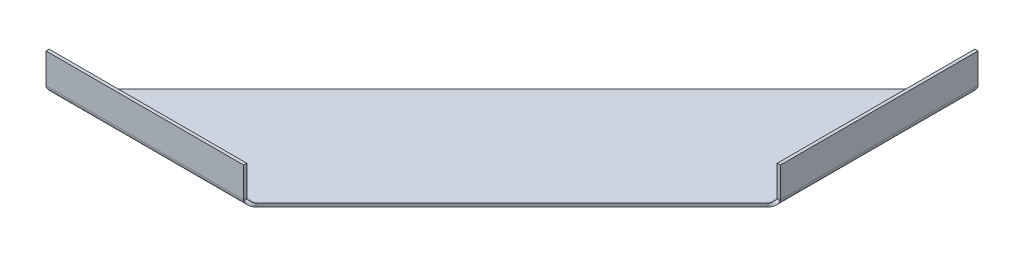
ISO-10303-21;
HEADER;
FILE_DESCRIPTION(('STEP AP214'),'2;1');
FILE_NAME('part.step','',(''),(''),'','','');
FILE_SCHEMA(('AUTOMOTIVE_DESIGN { 1 0 10303 214 1 1 1 1 }'));
ENDSEC;
DATA;
#1=APPLICATION_CONTEXT('core data for automotive mechanical design processes');
#2=APPLICATION_PROTOCOL_DEFINITION('international standard','automotive_design',2000,#1);
#3=PRODUCT_CONTEXT('',#1,'mechanical');
#4=PRODUCT('Part','Part','',(#3));
#5=PRODUCT_RELATED_PRODUCT_CATEGORY('part','',(#4));
#6=PRODUCT_DEFINITION_FORMATION('','',#4);
#7=PRODUCT_DEFINITION_CONTEXT('part definition',#1,'design');
#8=PRODUCT_DEFINITION('design','',#6,#7);
#9=PRODUCT_DEFINITION_SHAPE('','',#8);
#10=(LENGTH_UNIT() NAMED_UNIT(*) SI_UNIT(.MILLI.,.METRE.));
#11=(NAMED_UNIT(*) PLANE_ANGLE_UNIT() SI_UNIT($,.RADIAN.));
#12=(NAMED_UNIT(*) SI_UNIT($,.STERADIAN.) SOLID_ANGLE_UNIT());
#13=UNCERTAINTY_MEASURE_WITH_UNIT(LENGTH_MEASURE(1.E-05),#10,'distance_accuracy_value','');
#14=(GEOMETRIC_REPRESENTATION_CONTEXT(3) GLOBAL_UNCERTAINTY_ASSIGNED_CONTEXT((#13)) GLOBAL_UNIT_ASSIGNED_CONTEXT((#10,
#11,#12)) REPRESENTATION_CONTEXT('',''));
#15=CARTESIAN_POINT('',(0.,0.,0.));
#16=DIRECTION('',(0.,0.,1.));
#17=DIRECTION('',(1.,0.,0.));
#18=AXIS2_PLACEMENT_3D('',#15,#16,#17);
#19=CARTESIAN_POINT('',(0.,0.,0.));
#20=DIRECTION('',(0.,1.,0.));
#21=DIRECTION('',(0.,0.,1.));
#22=AXIS2_PLACEMENT_3D('',#19,#20,#21);
#23=PLANE('',#22);
#24=DIRECTION('',(0.707106781186548,0.,-0.707106781186547));
#25=VECTOR('',#24,1.);
#26=CARTESIAN_POINT('',(161.644610179245,0.,0.));
#27=LINE('',#26,#25);
#28=CARTESIAN_POINT('',(166.724610179245,0.,-5.07999999999998));
#29=VERTEX_POINT('',#28);
#30=CARTESIAN_POINT('',(375.92,0.,-214.275389820755));
#31=VERTEX_POINT('',#30);
#32=EDGE_CURVE('E543',#29,#31,#27,.T.);
#33=ORIENTED_EDGE('',*,*,#32,.T.);
#34=DIRECTION('',(0.,0.,-1.));
#35=VECTOR('',#34,1.);
#36=CARTESIAN_POINT('',(375.92,0.,0.));
#37=LINE('',#36,#35);
#38=CARTESIAN_POINT('',(375.92,0.,-375.92));
#39=VERTEX_POINT('',#38);
#40=EDGE_CURVE('E81',#31,#39,#37,.T.);
#41=ORIENTED_EDGE('',*,*,#40,.T.);
#42=DIRECTION('',(-0.707106781186548,0.,0.707106781186548));
#43=VECTOR('',#42,1.);
#44=CARTESIAN_POINT('',(0.,0.,0.));
#45=LINE('',#44,#43);
#46=CARTESIAN_POINT('',(5.07999999999998,0.,-5.07999999999998));
#47=VERTEX_POINT('',#46);
#48=EDGE_CURVE('E97',#39,#47,#45,.T.);
#49=ORIENTED_EDGE('',*,*,#48,.T.);
#50=DIRECTION('',(-1.,0.,0.));
#51=VECTOR('',#50,1.);
#52=CARTESIAN_POINT('',(0.,0.,-5.07999999999998));
#53=LINE('',#52,#51);
#54=EDGE_CURVE('E973',#29,#47,#53,.T.);
#55=ORIENTED_EDGE('',*,*,#54,.F.);
#56=EDGE_LOOP('',(#33,#41,#49,#55));
#57=FACE_BOUND('',#56,.T.);
#58=ADVANCED_FACE('F71',(#57),#23,.T.);
#59=CARTESIAN_POINT('',(161.644610179245,-2.54,0.));
#60=DIRECTION('',(0.707106781186547,0.,0.707106781186548));
#61=DIRECTION('',(0.707106781186548,0.,-0.707106781186547));
#62=AXIS2_PLACEMENT_3D('',#59,#60,#61);
#63=PLANE('',#62);
#64=DIRECTION('',(0.707106781186548,0.,-0.707106781186547));
#65=VECTOR('',#64,1.);
#66=CARTESIAN_POINT('',(161.644610179245,-2.54,0.));
#67=LINE('',#66,#65);
#68=CARTESIAN_POINT('',(166.724610179245,-2.54,-5.07999999999998));
#69=VERTEX_POINT('',#68);
#70=CARTESIAN_POINT('',(375.92,-2.54,-214.275389820755));
#71=VERTEX_POINT('',#70);
#72=EDGE_CURVE('E531',#69,#71,#67,.T.);
#73=ORIENTED_EDGE('',*,*,#72,.T.);
#74=CARTESIAN_POINT('',(375.92,0.,-214.275389820755));
#75=CARTESIAN_POINT('',(375.92,-2.54,-214.275389820755));
#76=B_SPLINE_CURVE_WITH_KNOTS('',1,(#74,#75),.UNSPECIFIED.,.F.,.F.,(2,2),(0.,1.),.UNSPECIFIED.);
#77=EDGE_CURVE('E12',#71,#31,#76,.F.);
#78=ORIENTED_EDGE('',*,*,#77,.T.);
#79=ORIENTED_EDGE('',*,*,#32,.F.);
#80=CARTESIAN_POINT('',(166.724610179245,-2.54,-5.07999999999997));
#81=CARTESIAN_POINT('',(166.724610179245,0.,-5.07999999999998));
#82=B_SPLINE_CURVE_WITH_KNOTS('',1,(#80,#81),.UNSPECIFIED.,.F.,.F.,(2,2),(0.,1.),.UNSPECIFIED.);
#83=EDGE_CURVE('E514',#69,#29,#82,.T.);
#84=ORIENTED_EDGE('',*,*,#83,.F.);
#85=EDGE_LOOP('',(#73,#78,#79,#84));
#86=FACE_BOUND('',#85,.T.);
#87=ADVANCED_FACE('F553',(#86),#63,.T.);
#88=CARTESIAN_POINT('',(0.,-2.54,0.));
#89=DIRECTION('',(-0.707106781186548,0.,-0.707106781186547));
#90=DIRECTION('',(-0.707106781186547,0.,0.707106781186548));
#91=AXIS2_PLACEMENT_3D('',#88,#89,#90);
#92=PLANE('',#91);
#93=ORIENTED_EDGE('',*,*,#48,.F.);
#94=CARTESIAN_POINT('',(375.92,-2.54,-375.92));
#95=CARTESIAN_POINT('',(375.92,0.,-375.92));
#96=B_SPLINE_CURVE_WITH_KNOTS('',1,(#94,#95),.UNSPECIFIED.,.F.,.F.,(2,2),(0.,1.),.UNSPECIFIED.);
#97=CARTESIAN_POINT('',(375.92,-2.54,-375.92));
#98=VERTEX_POINT('',#97);
#99=EDGE_CURVE('E576',#39,#98,#96,.F.);
#100=ORIENTED_EDGE('',*,*,#99,.T.);
#101=DIRECTION('',(-0.707106781186548,0.,0.707106781186548));
#102=VECTOR('',#101,1.);
#103=CARTESIAN_POINT('',(0.,-2.54,0.));
#104=LINE('',#103,#102);
#105=CARTESIAN_POINT('',(5.08000000000008,-2.54,-5.07999999999998));
#106=VERTEX_POINT('',#105);
#107=EDGE_CURVE('E525',#98,#106,#104,.T.);
#108=ORIENTED_EDGE('',*,*,#107,.T.);
#109=CARTESIAN_POINT('',(5.08000000000011,0.,-5.07999999999998));
#110=CARTESIAN_POINT('',(5.08000000000008,-2.54,-5.07999999999998));
#111=B_SPLINE_CURVE_WITH_KNOTS('',1,(#109,#110),.UNSPECIFIED.,.F.,.F.,(2,2),(0.,1.),.UNSPECIFIED.);
#112=EDGE_CURVE('E577',#47,#106,#111,.T.);
#113=ORIENTED_EDGE('',*,*,#112,.F.);
#114=EDGE_LOOP('',(#93,#100,#108,#113));
#115=FACE_BOUND('',#114,.T.);
#116=ADVANCED_FACE('F474',(#115),#92,.T.);
#117=CARTESIAN_POINT('',(0.,-2.54,0.));
#118=DIRECTION('',(0.,1.,0.));
#119=DIRECTION('',(0.,0.,1.));
#120=AXIS2_PLACEMENT_3D('',#117,#118,#119);
#121=PLANE('',#120);
#122=DIRECTION('',(0.,0.,-1.));
#123=VECTOR('',#122,1.);
#124=CARTESIAN_POINT('',(375.92,-2.54,0.));
#125=LINE('',#124,#123);
#126=EDGE_CURVE('E569',#71,#98,#125,.T.);
#127=ORIENTED_EDGE('',*,*,#126,.F.);
#128=ORIENTED_EDGE('',*,*,#72,.F.);
#129=DIRECTION('',(-1.,0.,0.));
#130=VECTOR('',#129,1.);
#131=CARTESIAN_POINT('',(0.,-2.54,-5.07999999999998));
#132=LINE('',#131,#130);
#133=EDGE_CURVE('E518',#69,#106,#132,.T.);
#134=ORIENTED_EDGE('',*,*,#133,.T.);
#135=ORIENTED_EDGE('',*,*,#107,.F.);
#136=EDGE_LOOP('',(#127,#128,#134,#135));
#137=FACE_BOUND('',#136,.T.);
#138=ADVANCED_FACE('F561',(#137),#121,.F.);
#139=CARTESIAN_POINT('',(161.644610179245,2.54,-5.07999999999998));
#140=DIRECTION('',(1.,0.,0.));
#141=DIRECTION('',(0.,0.,-1.));
#142=AXIS2_PLACEMENT_3D('',#139,#140,#141);
#143=PLANE('',#142);
#144=CARTESIAN_POINT('',(161.644610179245,1.94249656381039,-2.61127773053717));
#145=CARTESIAN_POINT('',(161.644610179245,1.34499312762079,-0.142555461074356));
#146=B_SPLINE_CURVE_WITH_KNOTS('',1,(#144,#145),.UNSPECIFIED.,.F.,.F.,(2,2),(0.,1.),.UNSPECIFIED.);
#147=CARTESIAN_POINT('',(161.644610179245,1.9424965638104,-2.61127773053717));
#148=VERTEX_POINT('',#147);
#149=CARTESIAN_POINT('',(161.644610179245,1.34499312762079,-0.142555461074355));
#150=VERTEX_POINT('',#149);
#151=EDGE_CURVE('E504',#148,#150,#146,.T.);
#152=ORIENTED_EDGE('',*,*,#151,.F.);
#153=CARTESIAN_POINT('',(161.644610179245,2.54,-5.07999999999998));
#154=DIRECTION('',(-1.,0.,0.));
#155=DIRECTION('',(0.,0.,1.));
#156=AXIS2_PLACEMENT_3D('',#153,#154,#155);
#157=CIRCLE('',#156,2.54);
#158=CARTESIAN_POINT('',(161.644610179245,2.54,-2.53999999999998));
#159=VERTEX_POINT('',#158);
#160=EDGE_CURVE('E646',#148,#159,#157,.T.);
#161=ORIENTED_EDGE('',*,*,#160,.T.);
#162=DIRECTION('',(0.,0.,-1.));
#163=VECTOR('',#162,1.);
#164=CARTESIAN_POINT('',(161.644610179245,2.54000000000001,0.));
#165=LINE('',#164,#163);
#166=CARTESIAN_POINT('',(161.644610179245,2.54000000000001,0.));
#167=VERTEX_POINT('',#166);
#168=EDGE_CURVE('E710',#167,#159,#165,.T.);
#169=ORIENTED_EDGE('',*,*,#168,.F.);
#170=CARTESIAN_POINT('',(161.644610179245,2.54,-5.07999999999998));
#171=DIRECTION('',(-1.,0.,0.));
#172=DIRECTION('',(0.,0.,-1.));
#173=AXIS2_PLACEMENT_3D('',#170,#171,#172);
#174=CIRCLE('',#173,5.08);
#175=EDGE_CURVE('E627',#150,#167,#174,.T.);
#176=ORIENTED_EDGE('',*,*,#175,.F.);
#177=EDGE_LOOP('',(#152,#161,#169,#176));
#178=FACE_BOUND('',#177,.T.);
#179=ADVANCED_FACE('F471',(#178),#143,.T.);
#180=CARTESIAN_POINT('',(1.11022302462516E-13,2.54,-5.07999999999998));
#181=DIRECTION('',(-1.,0.,0.));
#182=DIRECTION('',(0.,0.,1.));
#183=AXIS2_PLACEMENT_3D('',#180,#181,#182);
#184=PLANE('',#183);
#185=DIRECTION('',(0.,0.,1.));
#186=VECTOR('',#185,1.);
#187=CARTESIAN_POINT('',(0.,2.54000000000002,0.));
#188=LINE('',#187,#186);
#189=CARTESIAN_POINT('',(0.,2.54000000000001,-2.53999999999998));
#190=VERTEX_POINT('',#189);
#191=CARTESIAN_POINT('',(1.11022302462516E-13,2.54000000000002,0.));
#192=VERTEX_POINT('',#191);
#193=EDGE_CURVE('E717',#190,#192,#188,.T.);
#194=ORIENTED_EDGE('',*,*,#193,.F.);
#195=CARTESIAN_POINT('',(2.22044604925031E-13,2.54,-5.07999999999998));
#196=DIRECTION('',(-1.,0.,0.));
#197=DIRECTION('',(0.,0.,1.));
#198=AXIS2_PLACEMENT_3D('',#195,#196,#197);
#199=CIRCLE('',#198,2.54);
#200=CARTESIAN_POINT('',(2.21978370881228E-13,1.9424965638104,-2.61127773053717));
#201=VERTEX_POINT('',#200);
#202=EDGE_CURVE('E639',#190,#201,#199,.F.);
#203=ORIENTED_EDGE('',*,*,#202,.T.);
#204=CARTESIAN_POINT('',(2.21912136837424E-13,1.34499312762079,-0.142555461074359));
#205=CARTESIAN_POINT('',(2.77423288068682E-13,1.9424965638104,-2.61127773053717));
#206=B_SPLINE_CURVE_WITH_KNOTS('',1,(#204,#205),.UNSPECIFIED.,.F.,.F.,(2,2),(0.,1.),.UNSPECIFIED.);
#207=CARTESIAN_POINT('',(1.10889834374908E-13,1.34499312762079,-0.142555461074359));
#208=VERTEX_POINT('',#207);
#209=EDGE_CURVE('E686',#201,#208,#206,.F.);
#210=ORIENTED_EDGE('',*,*,#209,.T.);
#211=CARTESIAN_POINT('',(1.11022302462516E-13,2.54,-5.07999999999998));
#212=DIRECTION('',(1.,0.,0.));
#213=DIRECTION('',(0.,0.,1.));
#214=AXIS2_PLACEMENT_3D('',#211,#212,#213);
#215=CIRCLE('',#214,5.08);
#216=EDGE_CURVE('E621',#192,#208,#215,.T.);
#217=ORIENTED_EDGE('',*,*,#216,.F.);
#218=EDGE_LOOP('',(#194,#203,#210,#217));
#219=FACE_BOUND('',#218,.T.);
#220=ADVANCED_FACE('F662',(#219),#184,.T.);
#221=CARTESIAN_POINT('',(2.21912136837424E-13,1.34499312762079,-0.142555461074359));
#222=CARTESIAN_POINT('',(0.423358755012111,0.796355234460727,-0.275341975961793));
#223=CARTESIAN_POINT('',(0.846666666666893,0.270227908725845,-0.500356762308083));
#224=CARTESIAN_POINT('',(1.69333333333354,-0.679699336346175,-1.11029803204367));
#225=CARTESIAN_POINT('',(2.11666666666683,-1.10327188479199,-1.49509170210052));
#226=CARTESIAN_POINT('',(2.96333333333348,-1.80134268470182,-2.38227109871094));
#227=CARTESIAN_POINT('',(3.38666666666679,-2.0756980584206,-2.884475241689));
#228=CARTESIAN_POINT('',(4.23333333333344,-2.44506451613714,-3.95122663886207));
#229=CARTESIAN_POINT('',(4.65664124498818,-2.54,-4.5155216599841));
#230=CARTESIAN_POINT('',(5.08000000000008,-2.54,-5.07999999999998));
#231=CARTESIAN_POINT('',(2.77423288068682E-13,1.9424965638104,-2.61127773053717));
#232=CARTESIAN_POINT('',(0.423345555294418,1.66818617010101,-2.67766891793451));
#233=CARTESIAN_POINT('',(0.846666666666949,1.40511395436292,-2.79017838115403));
#234=CARTESIAN_POINT('',(1.69333333333359,0.930150331826915,-3.09514901602183));
#235=CARTESIAN_POINT('',(2.11666666666689,0.718364057604003,-3.28754585105025));
#236=CARTESIAN_POINT('',(2.96333333333353,0.369328657649094,-3.73113554935546));
#237=CARTESIAN_POINT('',(3.38666666666682,0.232150970789699,-3.98223762084449));
#238=CARTESIAN_POINT('',(4.23333333333347,0.0474677419314325,-4.51561331943103));
#239=CARTESIAN_POINT('',(4.65665444470594,0.,-4.79776962980386));
#240=CARTESIAN_POINT('',(5.08000000000011,0.,-5.07999999999998));
#241=B_SPLINE_SURFACE_WITH_KNOTS('',1,3,((#221,#222,#223,#224,#225,#226,#227,#228,#229,#230),
(#231,#232,#233,#234,#235,#236,#237,#238,#239,#240)),.UNSPECIFIED.,.F.,.F.,.F.,(2,2),(4,2,2,2,
4),(0.,1.),(0.,0.25,0.5,0.75,1.),.UNSPECIFIED.);
#242=CARTESIAN_POINT('',(2.77423288068682E-13,1.9424965638104,-2.61127773053717));
#243=CARTESIAN_POINT('',(0.423345555294418,1.66818617010101,-2.67766891793451));
#244=CARTESIAN_POINT('',(0.846666666666949,1.40511395436292,-2.79017838115403));
#245=CARTESIAN_POINT('',(1.69333333333359,0.930150331826915,-3.09514901602183));
#246=CARTESIAN_POINT('',(2.11666666666689,0.718364057604003,-3.28754585105025));
#247=CARTESIAN_POINT('',(2.96333333333353,0.369328657649094,-3.73113554935546));
#248=CARTESIAN_POINT('',(3.38666666666682,0.232150970789699,-3.98223762084449));
#249=CARTESIAN_POINT('',(4.23333333333347,0.0474677419314325,-4.51561331943103));
#250=CARTESIAN_POINT('',(4.65665444470594,0.,-4.79776962980386));
#251=CARTESIAN_POINT('',(5.08000000000011,0.,-5.07999999999998));
#252=B_SPLINE_CURVE_WITH_KNOTS('',3,(#242,#243,#244,#245,#246,#247,#248,#249,#250,#251),
.UNSPECIFIED.,.F.,.F.,(4,2,2,2,4),(0.,0.25,0.5,0.75,1.),.UNSPECIFIED.);
#253=EDGE_CURVE('E634',#201,#47,#252,.T.);
#254=CARTESIAN_POINT('',(5.08000000000008,-2.54,-5.07999999999998));
#255=CARTESIAN_POINT('',(4.65664124498818,-2.54,-4.5155216599841));
#256=CARTESIAN_POINT('',(4.23333333333344,-2.44506451613714,-3.95122663886207));
#257=CARTESIAN_POINT('',(3.38666666666679,-2.0756980584206,-2.884475241689));
#258=CARTESIAN_POINT('',(2.96333333333348,-1.80134268470182,-2.38227109871094));
#259=CARTESIAN_POINT('',(2.11666666666683,-1.10327188479199,-1.49509170210052));
#260=CARTESIAN_POINT('',(1.69333333333354,-0.679699336346175,-1.11029803204367));
#261=CARTESIAN_POINT('',(0.846666666666893,0.270227908725845,-0.500356762308083));
#262=CARTESIAN_POINT('',(0.423358755012111,0.796355234460727,-0.275341975961793));
#263=CARTESIAN_POINT('',(2.21912136837424E-13,1.34499312762079,-0.142555461074359));
#264=B_SPLINE_CURVE_WITH_KNOTS('',3,(#254,#255,#256,#257,#258,#259,#260,#261,#262,#263),
.UNSPECIFIED.,.F.,.F.,(4,2,2,2,4),(0.,0.25,0.5,0.75,1.),.UNSPECIFIED.);
#265=EDGE_CURVE('E618',#208,#106,#264,.F.);
#266=ORIENTED_EDGE('',*,*,#209,.F.);
#267=ORIENTED_EDGE('',*,*,#253,.T.);
#268=ORIENTED_EDGE('',*,*,#112,.T.);
#269=ORIENTED_EDGE('',*,*,#265,.F.);
#270=EDGE_LOOP('',(#266,#267,#268,#269));
#271=FACE_BOUND('',#270,.T.);
#272=ADVANCED_FACE('F470',(#271),#241,.T.);
#273=CARTESIAN_POINT('',(166.724610179245,-2.54,-5.07999999999997));
#274=CARTESIAN_POINT('',(166.301251424233,-2.54,-4.51552165998405));
#275=CARTESIAN_POINT('',(165.877943512578,-2.44506451613714,-3.95122663886207));
#276=CARTESIAN_POINT('',(165.031276845911,-2.0756980584206,-2.88447524168899));
#277=CARTESIAN_POINT('',(164.607943512578,-1.80134268470182,-2.38227109871093));
#278=CARTESIAN_POINT('',(163.761276845911,-1.10327188479199,-1.49509170210051));
#279=CARTESIAN_POINT('',(163.337943512578,-0.679699336346175,-1.11029803204367));
#280=CARTESIAN_POINT('',(162.491276845911,0.270227908725844,-0.500356762308079));
#281=CARTESIAN_POINT('',(162.067968934257,0.79635523446066,-0.275341975961805));
#282=CARTESIAN_POINT('',(161.644610179245,1.34499312762079,-0.142555461074356));
#283=CARTESIAN_POINT('',(166.724610179245,0.,-5.07999999999998));
#284=CARTESIAN_POINT('',(166.301264623951,0.,-4.79776962980383));
#285=CARTESIAN_POINT('',(165.877943512578,0.0474677419314315,-4.51561331943102));
#286=CARTESIAN_POINT('',(165.031276845911,0.2321509707897,-3.98223762084448));
#287=CARTESIAN_POINT('',(164.607943512578,0.369328657649092,-3.73113554935546));
#288=CARTESIAN_POINT('',(163.761276845911,0.718364057604006,-3.28754585105025));
#289=CARTESIAN_POINT('',(163.337943512578,0.930150331826914,-3.09514901602182));
#290=CARTESIAN_POINT('',(162.491276845912,1.40511395436292,-2.79017838115403));
#291=CARTESIAN_POINT('',(162.067955734539,1.66818617010096,-2.67766891793452));
#292=CARTESIAN_POINT('',(161.644610179245,1.94249656381039,-2.61127773053717));
#293=B_SPLINE_SURFACE_WITH_KNOTS('',1,3,((#273,#274,#275,#276,#277,#278,#279,#280,#281,#282),
(#283,#284,#285,#286,#287,#288,#289,#290,#291,#292)),.UNSPECIFIED.,.F.,.F.,.F.,(2,2),(4,2,2,2,
4),(0.,1.),(0.,0.25,0.5,0.75,1.),.UNSPECIFIED.);
#294=CARTESIAN_POINT('',(166.724610179245,0.,-5.07999999999998));
#295=CARTESIAN_POINT('',(166.301264623951,0.,-4.79776962980383));
#296=CARTESIAN_POINT('',(165.877943512578,0.0474677419314315,-4.51561331943102));
#297=CARTESIAN_POINT('',(165.031276845911,0.2321509707897,-3.98223762084448));
#298=CARTESIAN_POINT('',(164.607943512578,0.369328657649092,-3.73113554935546));
#299=CARTESIAN_POINT('',(163.761276845911,0.718364057604006,-3.28754585105025));
#300=CARTESIAN_POINT('',(163.337943512578,0.930150331826914,-3.09514901602182));
#301=CARTESIAN_POINT('',(162.491276845912,1.40511395436292,-2.79017838115403));
#302=CARTESIAN_POINT('',(162.067955734539,1.66818617010096,-2.67766891793452));
#303=CARTESIAN_POINT('',(161.644610179245,1.94249656381039,-2.61127773053717));
#304=B_SPLINE_CURVE_WITH_KNOTS('',3,(#294,#295,#296,#297,#298,#299,#300,#301,#302,#303),
.UNSPECIFIED.,.F.,.F.,(4,2,2,2,4),(0.,0.25,0.5,0.75,1.),.UNSPECIFIED.);
#305=EDGE_CURVE('E443',#29,#148,#304,.T.);
#306=CARTESIAN_POINT('',(161.644610179245,1.34499312762079,-0.142555461074356));
#307=CARTESIAN_POINT('',(162.067968934257,0.79635523446066,-0.275341975961805));
#308=CARTESIAN_POINT('',(162.491276845911,0.270227908725844,-0.500356762308079));
#309=CARTESIAN_POINT('',(163.337943512578,-0.679699336346175,-1.11029803204367));
#310=CARTESIAN_POINT('',(163.761276845911,-1.10327188479199,-1.49509170210051));
#311=CARTESIAN_POINT('',(164.607943512578,-1.80134268470182,-2.38227109871093));
#312=CARTESIAN_POINT('',(165.031276845911,-2.0756980584206,-2.88447524168899));
#313=CARTESIAN_POINT('',(165.877943512578,-2.44506451613714,-3.95122663886207));
#314=CARTESIAN_POINT('',(166.301251424233,-2.54,-4.51552165998405));
#315=CARTESIAN_POINT('',(166.724610179245,-2.54,-5.07999999999997));
#316=B_SPLINE_CURVE_WITH_KNOTS('',3,(#306,#307,#308,#309,#310,#311,#312,#313,#314,#315),
.UNSPECIFIED.,.F.,.F.,(4,2,2,2,4),(0.,0.25,0.5,0.75,1.),.UNSPECIFIED.);
#317=EDGE_CURVE('E436',#69,#150,#316,.F.);
#318=ORIENTED_EDGE('',*,*,#305,.T.);
#319=ORIENTED_EDGE('',*,*,#151,.T.);
#320=ORIENTED_EDGE('',*,*,#317,.F.);
#321=ORIENTED_EDGE('',*,*,#83,.T.);
#322=EDGE_LOOP('',(#318,#319,#320,#321));
#323=FACE_BOUND('',#322,.T.);
#324=ADVANCED_FACE('F409',(#323),#293,.T.);
#325=CARTESIAN_POINT('',(252.753628969695,2.54,-5.07999999999998));
#326=DIRECTION('',(-1.,0.,0.));
#327=DIRECTION('',(0.,0.,1.));
#328=AXIS2_PLACEMENT_3D('',#325,#326,#327);
#329=CYLINDRICAL_SURFACE('',#328,5.08);
#330=ORIENTED_EDGE('',*,*,#133,.F.);
#331=ORIENTED_EDGE('',*,*,#317,.T.);
#332=ORIENTED_EDGE('',*,*,#175,.T.);
#333=DIRECTION('',(-1.,0.,0.));
#334=VECTOR('',#333,1.);
#335=CARTESIAN_POINT('',(0.,2.54000000000002,0.));
#336=LINE('',#335,#334);
#337=EDGE_CURVE('E739',#167,#192,#336,.T.);
#338=ORIENTED_EDGE('',*,*,#337,.T.);
#339=ORIENTED_EDGE('',*,*,#216,.T.);
#340=ORIENTED_EDGE('',*,*,#265,.T.);
#341=EDGE_LOOP('',(#330,#331,#332,#338,#339,#340));
#342=FACE_BOUND('',#341,.T.);
#343=ADVANCED_FACE('F405',(#342),#329,.T.);
#344=CARTESIAN_POINT('',(252.753628969695,2.54,-5.07999999999998));
#345=DIRECTION('',(-1.,0.,0.));
#346=DIRECTION('',(0.,0.,1.));
#347=AXIS2_PLACEMENT_3D('',#344,#345,#346);
#348=CYLINDRICAL_SURFACE('',#347,2.54);
#349=ORIENTED_EDGE('',*,*,#54,.T.);
#350=ORIENTED_EDGE('',*,*,#253,.F.);
#351=ORIENTED_EDGE('',*,*,#202,.F.);
#352=DIRECTION('',(-1.,0.,0.));
#353=VECTOR('',#352,1.);
#354=CARTESIAN_POINT('',(0.,2.54000000000001,-2.53999999999998));
#355=LINE('',#354,#353);
#356=EDGE_CURVE('E726',#159,#190,#355,.T.);
#357=ORIENTED_EDGE('',*,*,#356,.F.);
#358=ORIENTED_EDGE('',*,*,#160,.F.);
#359=ORIENTED_EDGE('',*,*,#305,.F.);
#360=EDGE_LOOP('',(#349,#350,#351,#357,#358,#359));
#361=FACE_BOUND('',#360,.T.);
#362=ADVANCED_FACE('F388',(#361),#348,.F.);
#363=CARTESIAN_POINT('',(0.,27.0352659949114,0.));
#364=DIRECTION('',(0.,1.,0.));
#365=DIRECTION('',(1.,0.,0.));
#366=AXIS2_PLACEMENT_3D('',#363,#364,#365);
#367=PLANE('',#366);
#368=DIRECTION('',(1.,0.,0.));
#369=VECTOR('',#368,1.);
#370=CARTESIAN_POINT('',(0.,27.0352659949114,-2.54000000000007));
#371=LINE('',#370,#369);
#372=CARTESIAN_POINT('',(0.,27.0352659949114,-2.54000000000007));
#373=VERTEX_POINT('',#372);
#374=CARTESIAN_POINT('',(161.644610179245,27.0352659949114,-2.54000000000006));
#375=VERTEX_POINT('',#374);
#376=EDGE_CURVE('E719',#373,#375,#371,.T.);
#377=ORIENTED_EDGE('',*,*,#376,.F.);
#378=DIRECTION('',(0.,0.,-1.));
#379=VECTOR('',#378,1.);
#380=CARTESIAN_POINT('',(0.,27.0352659949114,0.));
#381=LINE('',#380,#379);
#382=CARTESIAN_POINT('',(0.,27.0352659949114,0.));
#383=VERTEX_POINT('',#382);
#384=EDGE_CURVE('E374',#383,#373,#381,.T.);
#385=ORIENTED_EDGE('',*,*,#384,.F.);
#386=DIRECTION('',(1.,0.,0.));
#387=VECTOR('',#386,1.);
#388=CARTESIAN_POINT('',(0.,27.0352659949114,0.));
#389=LINE('',#388,#387);
#390=CARTESIAN_POINT('',(161.644610179245,27.0352659949114,0.));
#391=VERTEX_POINT('',#390);
#392=EDGE_CURVE('E737',#383,#391,#389,.T.);
#393=ORIENTED_EDGE('',*,*,#392,.T.);
#394=DIRECTION('',(0.,0.,-1.));
#395=VECTOR('',#394,1.);
#396=CARTESIAN_POINT('',(161.644610179245,27.0352659949114,0.));
#397=LINE('',#396,#395);
#398=EDGE_CURVE('E735',#391,#375,#397,.T.);
#399=ORIENTED_EDGE('',*,*,#398,.T.);
#400=EDGE_LOOP('',(#377,#385,#393,#399));
#401=FACE_BOUND('',#400,.T.);
#402=ADVANCED_FACE('F384',(#401),#367,.T.);
#403=CARTESIAN_POINT('',(0.,1.63526599491143,0.));
#404=DIRECTION('',(0.,0.,-1.));
#405=DIRECTION('',(0.,1.,0.));
#406=AXIS2_PLACEMENT_3D('',#403,#404,#405);
#407=PLANE('',#406);
#408=ORIENTED_EDGE('',*,*,#337,.F.);
#409=DIRECTION('',(0.,-1.,0.));
#410=VECTOR('',#409,1.);
#411=CARTESIAN_POINT('',(161.644610179245,1.63526599491142,0.));
#412=LINE('',#411,#410);
#413=EDGE_CURVE('E732',#391,#167,#412,.T.);
#414=ORIENTED_EDGE('',*,*,#413,.F.);
#415=ORIENTED_EDGE('',*,*,#392,.F.);
#416=DIRECTION('',(0.,1.,0.));
#417=VECTOR('',#416,1.);
#418=CARTESIAN_POINT('',(0.,1.63526599491143,0.));
#419=LINE('',#418,#417);
#420=EDGE_CURVE('E714',#192,#383,#419,.T.);
#421=ORIENTED_EDGE('',*,*,#420,.F.);
#422=EDGE_LOOP('',(#408,#414,#415,#421));
#423=FACE_BOUND('',#422,.T.);
#424=ADVANCED_FACE('F387',(#423),#407,.F.);
#425=CARTESIAN_POINT('',(161.644610179245,1.63526599491142,0.));
#426=DIRECTION('',(1.,0.,0.));
#427=DIRECTION('',(0.,-1.,0.));
#428=AXIS2_PLACEMENT_3D('',#425,#426,#427);
#429=PLANE('',#428);
#430=ORIENTED_EDGE('',*,*,#413,.T.);
#431=ORIENTED_EDGE('',*,*,#168,.T.);
#432=DIRECTION('',(0.,-1.,0.));
#433=VECTOR('',#432,1.);
#434=CARTESIAN_POINT('',(161.644610179245,1.63526599491142,-2.53999999999997));
#435=LINE('',#434,#433);
#436=EDGE_CURVE('E729',#375,#159,#435,.T.);
#437=ORIENTED_EDGE('',*,*,#436,.F.);
#438=ORIENTED_EDGE('',*,*,#398,.F.);
#439=EDGE_LOOP('',(#430,#431,#437,#438));
#440=FACE_BOUND('',#439,.T.);
#441=ADVANCED_FACE('F392',(#440),#429,.T.);
#442=CARTESIAN_POINT('',(0.,1.63526599491142,-2.53999999999998));
#443=DIRECTION('',(0.,0.,-1.));
#444=DIRECTION('',(0.,1.,0.));
#445=AXIS2_PLACEMENT_3D('',#442,#443,#444);
#446=PLANE('',#445);
#447=ORIENTED_EDGE('',*,*,#436,.T.);
#448=ORIENTED_EDGE('',*,*,#356,.T.);
#449=DIRECTION('',(0.,1.,0.));
#450=VECTOR('',#449,1.);
#451=CARTESIAN_POINT('',(0.,1.63526599491142,-2.53999999999998));
#452=LINE('',#451,#450);
#453=EDGE_CURVE('E724',#190,#373,#452,.T.);
#454=ORIENTED_EDGE('',*,*,#453,.T.);
#455=ORIENTED_EDGE('',*,*,#376,.T.);
#456=EDGE_LOOP('',(#447,#448,#454,#455));
#457=FACE_BOUND('',#456,.T.);
#458=ADVANCED_FACE('F396',(#457),#446,.T.);
#459=CARTESIAN_POINT('',(0.,1.63526599491143,0.));
#460=DIRECTION('',(-1.,0.,0.));
#461=DIRECTION('',(0.,1.,0.));
#462=AXIS2_PLACEMENT_3D('',#459,#460,#461);
#463=PLANE('',#462);
#464=ORIENTED_EDGE('',*,*,#453,.F.);
#465=ORIENTED_EDGE('',*,*,#193,.T.);
#466=ORIENTED_EDGE('',*,*,#420,.T.);
#467=ORIENTED_EDGE('',*,*,#384,.T.);
#468=EDGE_LOOP('',(#464,#465,#466,#467));
#469=FACE_BOUND('',#468,.T.);
#470=ADVANCED_FACE('F400',(#469),#463,.T.);
#471=CARTESIAN_POINT('',(375.92,2.54,-219.355389820755));
#472=DIRECTION('',(0.,0.,1.));
#473=DIRECTION('',(1.,0.,0.));
#474=AXIS2_PLACEMENT_3D('',#471,#472,#473);
#475=PLANE('',#474);
#476=DIRECTION('',(-1.,0.,0.));
#477=VECTOR('',#476,1.);
#478=CARTESIAN_POINT('',(381.,2.54000000000004,-219.355389820755));
#479=LINE('',#478,#477);
#480=CARTESIAN_POINT('',(381.,2.54000000000005,-219.355389820755));
#481=VERTEX_POINT('',#480);
#482=CARTESIAN_POINT('',(378.46,2.54000000000004,-219.355389820755));
#483=VERTEX_POINT('',#482);
#484=EDGE_CURVE('E195',#481,#483,#479,.T.);
#485=ORIENTED_EDGE('',*,*,#484,.T.);
#486=CARTESIAN_POINT('',(375.92,2.54,-219.355389820755));
#487=DIRECTION('',(0.,0.,1.));
#488=DIRECTION('',(1.,0.,0.));
#489=AXIS2_PLACEMENT_3D('',#486,#487,#488);
#490=CIRCLE('',#489,2.54);
#491=CARTESIAN_POINT('',(378.388722269463,1.94249656381041,-219.355389820755));
#492=VERTEX_POINT('',#491);
#493=EDGE_CURVE('E207',#483,#492,#490,.F.);
#494=ORIENTED_EDGE('',*,*,#493,.T.);
#495=CARTESIAN_POINT('',(380.857444538926,1.34499312762079,-219.355389820755));
#496=CARTESIAN_POINT('',(378.388722269463,1.94249656381039,-219.355389820755));
#497=B_SPLINE_CURVE_WITH_KNOTS('',1,(#495,#496),.UNSPECIFIED.,.F.,.F.,(2,2),(0.,1.),.UNSPECIFIED.);
#498=CARTESIAN_POINT('',(380.857444538926,1.34499312762081,-219.355389820755));
#499=VERTEX_POINT('',#498);
#500=EDGE_CURVE('E337',#492,#499,#497,.F.);
#501=ORIENTED_EDGE('',*,*,#500,.T.);
#502=CARTESIAN_POINT('',(375.92,2.54,-219.355389820755));
#503=DIRECTION('',(0.,0.,-1.));
#504=DIRECTION('',(1.,0.,0.));
#505=AXIS2_PLACEMENT_3D('',#502,#503,#504);
#506=CIRCLE('',#505,5.07999999999999);
#507=EDGE_CURVE('E268',#481,#499,#506,.T.);
#508=ORIENTED_EDGE('',*,*,#507,.F.);
#509=EDGE_LOOP('',(#485,#494,#501,#508));
#510=FACE_BOUND('',#509,.T.);
#511=ADVANCED_FACE('F305',(#510),#475,.T.);
#512=CARTESIAN_POINT('',(380.857444538926,1.34499312762079,-219.355389820755));
#513=CARTESIAN_POINT('',(380.724658024038,0.796355234460572,-218.932031065743));
#514=CARTESIAN_POINT('',(380.499643237692,0.270227908725844,-218.508723154089));
#515=CARTESIAN_POINT('',(379.889701967956,-0.679699336346176,-217.662056487422));
#516=CARTESIAN_POINT('',(379.5049082979,-1.10327188479199,-217.238723154089));
#517=CARTESIAN_POINT('',(378.617728901289,-1.80134268470182,-216.392056487422));
#518=CARTESIAN_POINT('',(378.115524758311,-2.0756980584206,-215.968723154089));
#519=CARTESIAN_POINT('',(377.048773361138,-2.44506451613714,-215.122056487422));
#520=CARTESIAN_POINT('',(376.484478340016,-2.54,-214.698748575767));
#521=CARTESIAN_POINT('',(375.92,-2.54,-214.275389820755));
#522=CARTESIAN_POINT('',(378.388722269463,1.94249656381039,-219.355389820755));
#523=CARTESIAN_POINT('',(378.322331082066,1.66818617010106,-218.932044265461));
#524=CARTESIAN_POINT('',(378.209821618846,1.40511395436292,-218.508723154089));
#525=CARTESIAN_POINT('',(377.904850983978,0.930150331826913,-217.662056487422));
#526=CARTESIAN_POINT('',(377.71245414895,0.718364057604002,-217.238723154089));
#527=CARTESIAN_POINT('',(377.268864450645,0.369328657649087,-216.392056487422));
#528=CARTESIAN_POINT('',(377.017762379156,0.2321509707897,-215.968723154089));
#529=CARTESIAN_POINT('',(376.484386680569,0.0474677419314291,-215.122056487422));
#530=CARTESIAN_POINT('',(376.202230370196,0.,-214.69873537605));
#531=CARTESIAN_POINT('',(375.92,0.,-214.275389820755));
#532=B_SPLINE_SURFACE_WITH_KNOTS('',1,3,((#512,#513,#514,#515,#516,#517,#518,#519,#520,#521),
(#522,#523,#524,#525,#526,#527,#528,#529,#530,#531)),.UNSPECIFIED.,.F.,.F.,.F.,(2,2),(4,2,2,2,
4),(0.,1.),(0.,0.25,0.5,0.75,1.),.UNSPECIFIED.);
#533=CARTESIAN_POINT('',(378.388722269463,1.94249656381039,-219.355389820755));
#534=CARTESIAN_POINT('',(378.322331082066,1.66818617010106,-218.932044265461));
#535=CARTESIAN_POINT('',(378.209821618846,1.40511395436292,-218.508723154089));
#536=CARTESIAN_POINT('',(377.904850983978,0.930150331826913,-217.662056487422));
#537=CARTESIAN_POINT('',(377.71245414895,0.718364057604002,-217.238723154089));
#538=CARTESIAN_POINT('',(377.268864450645,0.369328657649087,-216.392056487422));
#539=CARTESIAN_POINT('',(377.017762379156,0.2321509707897,-215.968723154089));
#540=CARTESIAN_POINT('',(376.484386680569,0.0474677419314291,-215.122056487422));
#541=CARTESIAN_POINT('',(376.202230370196,0.,-214.69873537605));
#542=CARTESIAN_POINT('',(375.92,0.,-214.275389820755));
#543=B_SPLINE_CURVE_WITH_KNOTS('',3,(#533,#534,#535,#536,#537,#538,#539,#540,#541,#542),
.UNSPECIFIED.,.F.,.F.,(4,2,2,2,4),(0.,0.25,0.5,0.75,1.),.UNSPECIFIED.);
#544=EDGE_CURVE('E88',#492,#31,#543,.T.);
#545=CARTESIAN_POINT('',(375.92,-2.54,-214.275389820755));
#546=CARTESIAN_POINT('',(376.484478340016,-2.54,-214.698748575767));
#547=CARTESIAN_POINT('',(377.048773361138,-2.44506451613714,-215.122056487422));
#548=CARTESIAN_POINT('',(378.115524758311,-2.0756980584206,-215.968723154089));
#549=CARTESIAN_POINT('',(378.617728901289,-1.80134268470182,-216.392056487422));
#550=CARTESIAN_POINT('',(379.5049082979,-1.10327188479199,-217.238723154089));
#551=CARTESIAN_POINT('',(379.889701967956,-0.679699336346176,-217.662056487422));
#552=CARTESIAN_POINT('',(380.499643237692,0.270227908725844,-218.508723154089));
#553=CARTESIAN_POINT('',(380.724658024038,0.796355234460572,-218.932031065743));
#554=CARTESIAN_POINT('',(380.857444538926,1.34499312762079,-219.355389820755));
#555=B_SPLINE_CURVE_WITH_KNOTS('',3,(#545,#546,#547,#548,#549,#550,#551,#552,#553,#554),
.UNSPECIFIED.,.F.,.F.,(4,2,2,2,4),(0.,0.25,0.5,0.75,1.),.UNSPECIFIED.);
#556=EDGE_CURVE('E266',#499,#71,#555,.F.);
#557=ORIENTED_EDGE('',*,*,#500,.F.);
#558=ORIENTED_EDGE('',*,*,#544,.T.);
#559=ORIENTED_EDGE('',*,*,#77,.F.);
#560=ORIENTED_EDGE('',*,*,#556,.F.);
#561=EDGE_LOOP('',(#557,#558,#559,#560));
#562=FACE_BOUND('',#561,.T.);
#563=ADVANCED_FACE('F293',(#562),#532,.T.);
#564=CARTESIAN_POINT('',(375.92,-2.54,-375.92));
#565=CARTESIAN_POINT('',(376.484478340016,-2.53999999999997,-376.343358755012));
#566=CARTESIAN_POINT('',(377.048773361138,-2.44506451613709,-376.766666666667));
#567=CARTESIAN_POINT('',(378.115524758311,-2.07569805842053,-377.613333333334));
#568=CARTESIAN_POINT('',(378.617728901289,-1.80134268470175,-378.036666666667));
#569=CARTESIAN_POINT('',(379.5049082979,-1.10327188479194,-378.883333333333));
#570=CARTESIAN_POINT('',(379.889701967956,-0.679699336346153,-379.306666666667));
#571=CARTESIAN_POINT('',(380.499643237692,0.270227908725814,-380.153333333333));
#572=CARTESIAN_POINT('',(380.724658024038,0.796355234460571,-380.576641244988));
#573=CARTESIAN_POINT('',(380.857444538926,1.34499312762069,-381.));
#574=CARTESIAN_POINT('',(375.92,0.,-375.92));
#575=CARTESIAN_POINT('',(376.202230370196,0.,-376.343345555295));
#576=CARTESIAN_POINT('',(376.484386680569,0.0474677419314558,-376.766666666667));
#577=CARTESIAN_POINT('',(377.017762379156,0.232150970789737,-377.613333333334));
#578=CARTESIAN_POINT('',(377.268864450645,0.369328657649125,-378.036666666667));
#579=CARTESIAN_POINT('',(377.71245414895,0.718364057604029,-378.883333333333));
#580=CARTESIAN_POINT('',(377.904850983978,0.930150331826923,-379.306666666667));
#581=CARTESIAN_POINT('',(378.209821618846,1.40511395436291,-380.153333333333));
#582=CARTESIAN_POINT('',(378.322331082065,1.66818617010095,-380.576654444706));
#583=CARTESIAN_POINT('',(378.388722269463,1.94249656381035,-381.));
#584=B_SPLINE_SURFACE_WITH_KNOTS('',1,3,((#564,#565,#566,#567,#568,#569,#570,#571,#572,#573),
(#574,#575,#576,#577,#578,#579,#580,#581,#582,#583)),.UNSPECIFIED.,.F.,.F.,.F.,(2,2),(4,2,2,2,
4),(0.,1.),(0.,0.25,0.5,0.75,1.),.UNSPECIFIED.);
#585=CARTESIAN_POINT('',(375.92,0.,-375.92));
#586=CARTESIAN_POINT('',(376.202230370196,0.,-376.343345555295));
#587=CARTESIAN_POINT('',(376.484386680569,0.0474677419314558,-376.766666666667));
#588=CARTESIAN_POINT('',(377.017762379156,0.232150970789737,-377.613333333334));
#589=CARTESIAN_POINT('',(377.268864450645,0.369328657649125,-378.036666666667));
#590=CARTESIAN_POINT('',(377.71245414895,0.718364057604029,-378.883333333333));
#591=CARTESIAN_POINT('',(377.904850983978,0.930150331826923,-379.306666666667));
#592=CARTESIAN_POINT('',(378.209821618846,1.40511395436291,-380.153333333333));
#593=CARTESIAN_POINT('',(378.322331082065,1.66818617010095,-380.576654444706));
#594=CARTESIAN_POINT('',(378.388722269463,1.94249656381035,-381.));
#595=B_SPLINE_CURVE_WITH_KNOTS('',3,(#585,#586,#587,#588,#589,#590,#591,#592,#593,#594),
.UNSPECIFIED.,.F.,.F.,(4,2,2,2,4),(0.,0.25,0.5,0.75,1.),.UNSPECIFIED.);
#596=CARTESIAN_POINT('',(378.388722269463,1.94249656381034,-381.));
#597=VERTEX_POINT('',#596);
#598=EDGE_CURVE('E586',#39,#597,#595,.T.);
#599=CARTESIAN_POINT('',(378.388722269463,1.94249656381035,-381.));
#600=CARTESIAN_POINT('',(380.857444538926,1.34499312762069,-381.));
#601=B_SPLINE_CURVE_WITH_KNOTS('',1,(#599,#600),.UNSPECIFIED.,.F.,.F.,(2,2),(0.,1.),.UNSPECIFIED.);
#602=CARTESIAN_POINT('',(380.857444538926,1.34499312762069,-381.));
#603=VERTEX_POINT('',#602);
#604=EDGE_CURVE('E358',#597,#603,#601,.T.);
#605=CARTESIAN_POINT('',(380.857444538926,1.34499312762069,-381.));
#606=CARTESIAN_POINT('',(380.724658024038,0.796355234460571,-380.576641244988));
#607=CARTESIAN_POINT('',(380.499643237692,0.270227908725814,-380.153333333333));
#608=CARTESIAN_POINT('',(379.889701967956,-0.679699336346153,-379.306666666667));
#609=CARTESIAN_POINT('',(379.5049082979,-1.10327188479194,-378.883333333333));
#610=CARTESIAN_POINT('',(378.617728901289,-1.80134268470175,-378.036666666667));
#611=CARTESIAN_POINT('',(378.115524758311,-2.07569805842053,-377.613333333334));
#612=CARTESIAN_POINT('',(377.048773361138,-2.44506451613709,-376.766666666667));
#613=CARTESIAN_POINT('',(376.484478340016,-2.53999999999997,-376.343358755012));
#614=CARTESIAN_POINT('',(375.92,-2.54,-375.92));
#615=B_SPLINE_CURVE_WITH_KNOTS('',3,(#605,#606,#607,#608,#609,#610,#611,#612,#613,#614),
.UNSPECIFIED.,.F.,.F.,(4,2,2,2,4),(0.,0.25,0.5,0.75,1.),.UNSPECIFIED.);
#616=EDGE_CURVE('E603',#98,#603,#615,.F.);
#617=ORIENTED_EDGE('',*,*,#99,.F.);
#618=ORIENTED_EDGE('',*,*,#598,.T.);
#619=ORIENTED_EDGE('',*,*,#604,.T.);
#620=ORIENTED_EDGE('',*,*,#616,.F.);
#621=EDGE_LOOP('',(#617,#618,#619,#620));
#622=FACE_BOUND('',#621,.T.);
#623=ADVANCED_FACE('F304',(#622),#584,.T.);
#624=CARTESIAN_POINT('',(375.92,2.54,-381.));
#625=DIRECTION('',(0.,0.,-1.));
#626=DIRECTION('',(-1.,0.,0.));
#627=AXIS2_PLACEMENT_3D('',#624,#625,#626);
#628=PLANE('',#627);
#629=CARTESIAN_POINT('',(375.92,2.54,-381.));
#630=DIRECTION('',(0.,0.,1.));
#631=DIRECTION('',(1.,0.,0.));
#632=AXIS2_PLACEMENT_3D('',#629,#630,#631);
#633=CIRCLE('',#632,2.54);
#634=CARTESIAN_POINT('',(378.46,2.54000000000004,-381.));
#635=VERTEX_POINT('',#634);
#636=EDGE_CURVE('E270',#597,#635,#633,.T.);
#637=ORIENTED_EDGE('',*,*,#636,.T.);
#638=DIRECTION('',(1.,0.,0.));
#639=VECTOR('',#638,1.);
#640=CARTESIAN_POINT('',(381.,2.53999999999999,-381.));
#641=LINE('',#640,#639);
#642=CARTESIAN_POINT('',(381.,2.53999999999999,-381.));
#643=VERTEX_POINT('',#642);
#644=EDGE_CURVE('E214',#635,#643,#641,.T.);
#645=ORIENTED_EDGE('',*,*,#644,.T.);
#646=CARTESIAN_POINT('',(375.92,2.54,-381.));
#647=DIRECTION('',(0.,0.,1.));
#648=DIRECTION('',(-1.,0.,0.));
#649=AXIS2_PLACEMENT_3D('',#646,#647,#648);
#650=CIRCLE('',#649,5.07999999999998);
#651=EDGE_CURVE('E613',#603,#643,#650,.T.);
#652=ORIENTED_EDGE('',*,*,#651,.F.);
#653=ORIENTED_EDGE('',*,*,#604,.F.);
#654=EDGE_LOOP('',(#637,#645,#652,#653));
#655=FACE_BOUND('',#654,.T.);
#656=ADVANCED_FACE('F243',(#655),#628,.T.);
#657=CARTESIAN_POINT('',(375.92,2.54,-461.94901879045));
#658=DIRECTION('',(0.,0.,1.));
#659=DIRECTION('',(1.,0.,0.));
#660=AXIS2_PLACEMENT_3D('',#657,#658,#659);
#661=CYLINDRICAL_SURFACE('',#660,5.08);
#662=ORIENTED_EDGE('',*,*,#616,.T.);
#663=ORIENTED_EDGE('',*,*,#651,.T.);
#664=DIRECTION('',(0.,0.,-1.));
#665=VECTOR('',#664,1.);
#666=CARTESIAN_POINT('',(381.,2.5400000000001,-1.3115173726969E-13));
#667=LINE('',#666,#665);
#668=EDGE_CURVE('E216',#481,#643,#667,.T.);
#669=ORIENTED_EDGE('',*,*,#668,.F.);
#670=ORIENTED_EDGE('',*,*,#507,.T.);
#671=ORIENTED_EDGE('',*,*,#556,.T.);
#672=ORIENTED_EDGE('',*,*,#126,.T.);
#673=EDGE_LOOP('',(#662,#663,#669,#670,#671,#672));
#674=FACE_BOUND('',#673,.T.);
#675=ADVANCED_FACE('F232',(#674),#661,.T.);
#676=CARTESIAN_POINT('',(375.92,2.54,-461.94901879045));
#677=DIRECTION('',(0.,0.,1.));
#678=DIRECTION('',(1.,0.,0.));
#679=AXIS2_PLACEMENT_3D('',#676,#677,#678);
#680=CYLINDRICAL_SURFACE('',#679,2.54);
#681=ORIENTED_EDGE('',*,*,#598,.F.);
#682=ORIENTED_EDGE('',*,*,#40,.F.);
#683=ORIENTED_EDGE('',*,*,#544,.F.);
#684=ORIENTED_EDGE('',*,*,#493,.F.);
#685=DIRECTION('',(0.,0.,-1.));
#686=VECTOR('',#685,1.);
#687=CARTESIAN_POINT('',(378.46,2.5400000000001,-1.3115173726969E-13));
#688=LINE('',#687,#686);
#689=EDGE_CURVE('E219',#483,#635,#688,.T.);
#690=ORIENTED_EDGE('',*,*,#689,.T.);
#691=ORIENTED_EDGE('',*,*,#636,.F.);
#692=EDGE_LOOP('',(#681,#682,#683,#684,#690,#691));
#693=FACE_BOUND('',#692,.T.);
#694=ADVANCED_FACE('F242',(#693),#680,.F.);
#695=CARTESIAN_POINT('',(381.,27.0352659949113,-381.));
#696=DIRECTION('',(0.,1.,0.));
#697=DIRECTION('',(0.,0.,-1.));
#698=AXIS2_PLACEMENT_3D('',#695,#696,#697);
#699=PLANE('',#698);
#700=DIRECTION('',(0.,0.,-1.));
#701=VECTOR('',#700,1.);
#702=CARTESIAN_POINT('',(378.46,27.0352659949113,-381.));
#703=LINE('',#702,#701);
#704=CARTESIAN_POINT('',(378.46,27.0352659949113,-219.355389820755));
#705=VERTEX_POINT('',#704);
#706=CARTESIAN_POINT('',(378.46,27.0352659949113,-381.));
#707=VERTEX_POINT('',#706);
#708=EDGE_CURVE('E206',#705,#707,#703,.T.);
#709=ORIENTED_EDGE('',*,*,#708,.F.);
#710=DIRECTION('',(-1.,0.,0.));
#711=VECTOR('',#710,1.);
#712=CARTESIAN_POINT('',(381.,27.0352659949113,-219.355389820755));
#713=LINE('',#712,#711);
#714=CARTESIAN_POINT('',(381.,27.0352659949113,-219.355389820755));
#715=VERTEX_POINT('',#714);
#716=EDGE_CURVE('E192',#715,#705,#713,.T.);
#717=ORIENTED_EDGE('',*,*,#716,.F.);
#718=DIRECTION('',(0.,0.,-1.));
#719=VECTOR('',#718,1.);
#720=CARTESIAN_POINT('',(381.,27.0352659949113,-381.));
#721=LINE('',#720,#719);
#722=CARTESIAN_POINT('',(381.,27.0352659949113,-381.));
#723=VERTEX_POINT('',#722);
#724=EDGE_CURVE('E204',#715,#723,#721,.T.);
#725=ORIENTED_EDGE('',*,*,#724,.T.);
#726=DIRECTION('',(-1.,0.,0.));
#727=VECTOR('',#726,1.);
#728=CARTESIAN_POINT('',(381.,27.0352659949113,-381.));
#729=LINE('',#728,#727);
#730=EDGE_CURVE('E213',#723,#707,#729,.T.);
#731=ORIENTED_EDGE('',*,*,#730,.T.);
#732=EDGE_LOOP('',(#709,#717,#725,#731));
#733=FACE_BOUND('',#732,.T.);
#734=ADVANCED_FACE('F203',(#733),#699,.T.);
#735=CARTESIAN_POINT('',(381.000000000001,-379.364734005089,0.));
#736=DIRECTION('',(-1.,0.,0.));
#737=DIRECTION('',(0.,0.,1.));
#738=AXIS2_PLACEMENT_3D('',#735,#736,#737);
#739=PLANE('',#738);
#740=DIRECTION('',(0.,1.,0.));
#741=VECTOR('',#740,1.);
#742=CARTESIAN_POINT('',(381.,1.63526599491143,-219.355389820755));
#743=LINE('',#742,#741);
#744=EDGE_CURVE('E189',#481,#715,#743,.T.);
#745=ORIENTED_EDGE('',*,*,#744,.F.);
#746=ORIENTED_EDGE('',*,*,#668,.T.);
#747=DIRECTION('',(0.,-1.,0.));
#748=VECTOR('',#747,1.);
#749=CARTESIAN_POINT('',(381.,1.63526599491137,-381.));
#750=LINE('',#749,#748);
#751=EDGE_CURVE('E212',#723,#643,#750,.T.);
#752=ORIENTED_EDGE('',*,*,#751,.F.);
#753=ORIENTED_EDGE('',*,*,#724,.F.);
#754=EDGE_LOOP('',(#745,#746,#752,#753));
#755=FACE_BOUND('',#754,.T.);
#756=ADVANCED_FACE('F210',(#755),#739,.F.);
#757=CARTESIAN_POINT('',(381.,1.63526599491137,-381.));
#758=DIRECTION('',(0.,0.,-1.));
#759=DIRECTION('',(0.,-1.,0.));
#760=AXIS2_PLACEMENT_3D('',#757,#758,#759);
#761=PLANE('',#760);
#762=ORIENTED_EDGE('',*,*,#644,.F.);
#763=DIRECTION('',(0.,-1.,0.));
#764=VECTOR('',#763,1.);
#765=CARTESIAN_POINT('',(378.46,1.63526599491137,-381.));
#766=LINE('',#765,#764);
#767=EDGE_CURVE('E199',#707,#635,#766,.T.);
#768=ORIENTED_EDGE('',*,*,#767,.F.);
#769=ORIENTED_EDGE('',*,*,#730,.F.);
#770=ORIENTED_EDGE('',*,*,#751,.T.);
#771=EDGE_LOOP('',(#762,#768,#769,#770));
#772=FACE_BOUND('',#771,.T.);
#773=ADVANCED_FACE('F743',(#772),#761,.T.);
#774=CARTESIAN_POINT('',(378.460000000001,-379.364734005089,0.));
#775=DIRECTION('',(-1.,0.,0.));
#776=DIRECTION('',(0.,0.,1.));
#777=AXIS2_PLACEMENT_3D('',#774,#775,#776);
#778=PLANE('',#777);
#779=ORIENTED_EDGE('',*,*,#689,.F.);
#780=DIRECTION('',(0.,1.,0.));
#781=VECTOR('',#780,1.);
#782=CARTESIAN_POINT('',(378.46,1.63526599491143,-219.355389820755));
#783=LINE('',#782,#781);
#784=EDGE_CURVE('E747',#483,#705,#783,.T.);
#785=ORIENTED_EDGE('',*,*,#784,.T.);
#786=ORIENTED_EDGE('',*,*,#708,.T.);
#787=ORIENTED_EDGE('',*,*,#767,.T.);
#788=EDGE_LOOP('',(#779,#785,#786,#787));
#789=FACE_BOUND('',#788,.T.);
#790=ADVANCED_FACE('F746',(#789),#778,.T.);
#791=CARTESIAN_POINT('',(381.,1.63526599491143,-219.355389820755));
#792=DIRECTION('',(0.,0.,1.));
#793=DIRECTION('',(0.,1.,0.));
#794=AXIS2_PLACEMENT_3D('',#791,#792,#793);
#795=PLANE('',#794);
#796=ORIENTED_EDGE('',*,*,#484,.F.);
#797=ORIENTED_EDGE('',*,*,#744,.T.);
#798=ORIENTED_EDGE('',*,*,#716,.T.);
#799=ORIENTED_EDGE('',*,*,#784,.F.);
#800=EDGE_LOOP('',(#796,#797,#798,#799));
#801=FACE_BOUND('',#800,.T.);
#802=ADVANCED_FACE('F191',(#801),#795,.T.);
#803=CLOSED_SHELL('',(#58,#87,#116,#138,#179,#220,#272,#324,#343,#362,#402,#424,#441,#458,#470,
#511,#563,#623,#656,#675,#694,#734,#756,#773,#790,#802));
#804=MANIFOLD_SOLID_BREP('B2',#803);
#805=ADVANCED_BREP_SHAPE_REPRESENTATION('',(#18,#804),#14);
#806=SHAPE_DEFINITION_REPRESENTATION(#9,#805);
ENDSEC;
END-ISO-10303-21;
